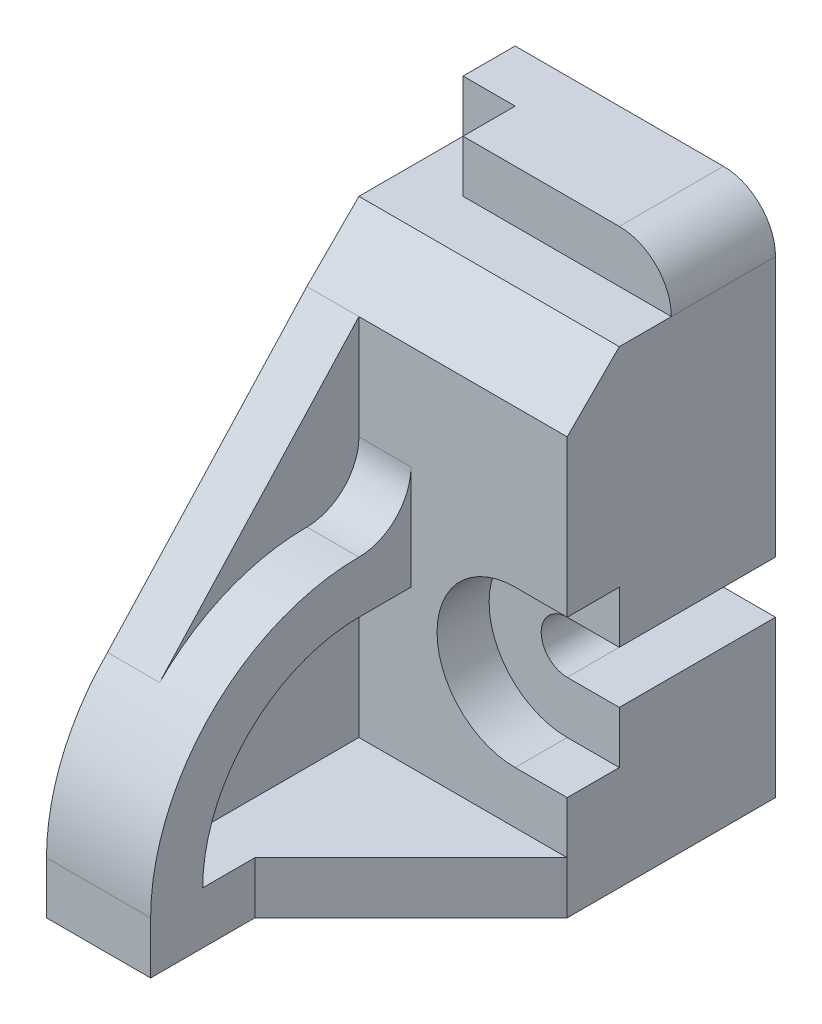
ISO-10303-21;
HEADER;
FILE_DESCRIPTION(('STEP AP214'),'2;1');
FILE_NAME('part.step','',(''),(''),'','','');
FILE_SCHEMA(('AUTOMOTIVE_DESIGN { 1 0 10303 214 1 1 1 1 }'));
ENDSEC;
DATA;
#1=APPLICATION_CONTEXT('core data for automotive mechanical design processes');
#2=APPLICATION_PROTOCOL_DEFINITION('international standard','automotive_design',2000,#1);
#3=PRODUCT_CONTEXT('',#1,'mechanical');
#4=PRODUCT('Part','Part','',(#3));
#5=PRODUCT_RELATED_PRODUCT_CATEGORY('part','',(#4));
#6=PRODUCT_DEFINITION_FORMATION('','',#4);
#7=PRODUCT_DEFINITION_CONTEXT('part definition',#1,'design');
#8=PRODUCT_DEFINITION('design','',#6,#7);
#9=PRODUCT_DEFINITION_SHAPE('','',#8);
#10=(LENGTH_UNIT() NAMED_UNIT(*) SI_UNIT(.MILLI.,.METRE.));
#11=(NAMED_UNIT(*) PLANE_ANGLE_UNIT() SI_UNIT($,.RADIAN.));
#12=(NAMED_UNIT(*) SI_UNIT($,.STERADIAN.) SOLID_ANGLE_UNIT());
#13=UNCERTAINTY_MEASURE_WITH_UNIT(LENGTH_MEASURE(1.E-05),#10,'distance_accuracy_value','');
#14=(GEOMETRIC_REPRESENTATION_CONTEXT(3) GLOBAL_UNCERTAINTY_ASSIGNED_CONTEXT((#13)) GLOBAL_UNIT_ASSIGNED_CONTEXT((#10,
#11,#12)) REPRESENTATION_CONTEXT('',''));
#15=CARTESIAN_POINT('',(0.,0.,0.));
#16=DIRECTION('',(0.,0.,1.));
#17=DIRECTION('',(1.,0.,0.));
#18=AXIS2_PLACEMENT_3D('',#15,#16,#17);
#19=CARTESIAN_POINT('',(0.,0.,4.));
#20=DIRECTION('',(0.,0.,1.));
#21=DIRECTION('',(1.,0.,0.));
#22=AXIS2_PLACEMENT_3D('',#19,#20,#21);
#23=PLANE('',#22);
#24=DIRECTION('',(1.,0.,0.));
#25=VECTOR('',#24,1.);
#26=CARTESIAN_POINT('',(0.,8.,4.));
#27=LINE('',#26,#25);
#28=CARTESIAN_POINT('',(1.,8.,4.));
#29=VERTEX_POINT('',#28);
#30=CARTESIAN_POINT('',(5.,8.,4.));
#31=VERTEX_POINT('',#30);
#32=EDGE_CURVE('E298',#29,#31,#27,.T.);
#33=ORIENTED_EDGE('',*,*,#32,.F.);
#34=DIRECTION('',(0.,-1.,0.));
#35=VECTOR('',#34,1.);
#36=CARTESIAN_POINT('',(1.,8.,4.));
#37=LINE('',#36,#35);
#38=CARTESIAN_POINT('',(1.,6.,4.));
#39=VERTEX_POINT('',#38);
#40=EDGE_CURVE('E245',#29,#39,#37,.T.);
#41=ORIENTED_EDGE('',*,*,#40,.T.);
#42=DIRECTION('',(-1.,0.,0.));
#43=VECTOR('',#42,1.);
#44=CARTESIAN_POINT('',(2.,6.,4.));
#45=LINE('',#44,#43);
#46=CARTESIAN_POINT('',(2.,6.,4.));
#47=VERTEX_POINT('',#46);
#48=EDGE_CURVE('E257',#47,#39,#45,.T.);
#49=ORIENTED_EDGE('',*,*,#48,.F.);
#50=DIRECTION('',(0.,1.,0.));
#51=VECTOR('',#50,1.);
#52=CARTESIAN_POINT('',(2.,0.,4.));
#53=LINE('',#52,#51);
#54=CARTESIAN_POINT('',(2.,4.,4.));
#55=VERTEX_POINT('',#54);
#56=EDGE_CURVE('E522',#55,#47,#53,.T.);
#57=ORIENTED_EDGE('',*,*,#56,.F.);
#58=DIRECTION('',(-1.,0.,0.));
#59=VECTOR('',#58,1.);
#60=CARTESIAN_POINT('',(2.,4.,4.));
#61=LINE('',#60,#59);
#62=CARTESIAN_POINT('',(1.,4.,4.));
#63=VERTEX_POINT('',#62);
#64=EDGE_CURVE('E261',#55,#63,#61,.T.);
#65=ORIENTED_EDGE('',*,*,#64,.T.);
#66=CARTESIAN_POINT('',(1.,1.,4.));
#67=VERTEX_POINT('',#66);
#68=EDGE_CURVE('E52',#63,#67,#37,.T.);
#69=ORIENTED_EDGE('',*,*,#68,.T.);
#70=DIRECTION('',(1.,0.,0.));
#71=VECTOR('',#70,1.);
#72=CARTESIAN_POINT('',(5.,1.,4.));
#73=LINE('',#72,#71);
#74=CARTESIAN_POINT('',(5.,1.,4.));
#75=VERTEX_POINT('',#74);
#76=EDGE_CURVE('E39',#67,#75,#73,.T.);
#77=ORIENTED_EDGE('',*,*,#76,.T.);
#78=DIRECTION('',(0.,-1.,0.));
#79=VECTOR('',#78,1.);
#80=CARTESIAN_POINT('',(5.,0.,4.));
#81=LINE('',#80,#79);
#82=CARTESIAN_POINT('',(5.,2.,4.));
#83=VERTEX_POINT('',#82);
#84=EDGE_CURVE('E381',#83,#75,#81,.T.);
#85=ORIENTED_EDGE('',*,*,#84,.F.);
#86=DIRECTION('',(1.,0.,0.));
#87=VECTOR('',#86,1.);
#88=CARTESIAN_POINT('',(5.,2.,4.));
#89=LINE('',#88,#87);
#90=CARTESIAN_POINT('',(4.,2.,4.));
#91=VERTEX_POINT('',#90);
#92=EDGE_CURVE('E341',#91,#83,#89,.T.);
#93=ORIENTED_EDGE('',*,*,#92,.F.);
#94=CARTESIAN_POINT('',(4.,3.5,4.));
#95=DIRECTION('',(0.,0.,1.));
#96=DIRECTION('',(1.,0.,0.));
#97=AXIS2_PLACEMENT_3D('',#94,#95,#96);
#98=CIRCLE('',#97,1.5);
#99=CARTESIAN_POINT('',(4.,5.,4.));
#100=VERTEX_POINT('',#99);
#101=EDGE_CURVE('E362',#100,#91,#98,.T.);
#102=ORIENTED_EDGE('',*,*,#101,.F.);
#103=DIRECTION('',(-1.,0.,0.));
#104=VECTOR('',#103,1.);
#105=CARTESIAN_POINT('',(5.,5.,4.));
#106=LINE('',#105,#104);
#107=CARTESIAN_POINT('',(5.,5.,4.));
#108=VERTEX_POINT('',#107);
#109=EDGE_CURVE('E332',#108,#100,#106,.T.);
#110=ORIENTED_EDGE('',*,*,#109,.F.);
#111=DIRECTION('',(0.,-1.,0.));
#112=VECTOR('',#111,1.);
#113=CARTESIAN_POINT('',(5.,0.,4.));
#114=LINE('',#113,#112);
#115=EDGE_CURVE('E378',#31,#108,#114,.T.);
#116=ORIENTED_EDGE('',*,*,#115,.F.);
#117=EDGE_LOOP('',(#33,#41,#49,#57,#65,#69,#77,#85,#93,#102,#110,#116));
#118=FACE_BOUND('',#117,.T.);
#119=ADVANCED_FACE('F35',(#118),#23,.T.);
#120=CARTESIAN_POINT('',(0.,1.,0.));
#121=DIRECTION('',(0.,1.,0.));
#122=DIRECTION('',(0.,0.,1.));
#123=AXIS2_PLACEMENT_3D('',#120,#121,#122);
#124=PLANE('',#123);
#125=ORIENTED_EDGE('',*,*,#76,.F.);
#126=DIRECTION('',(0.,0.,1.));
#127=VECTOR('',#126,1.);
#128=CARTESIAN_POINT('',(1.,1.,4.));
#129=LINE('',#128,#127);
#130=CARTESIAN_POINT('',(1.,1.,8.));
#131=VERTEX_POINT('',#130);
#132=EDGE_CURVE('E529',#67,#131,#129,.T.);
#133=ORIENTED_EDGE('',*,*,#132,.T.);
#134=DIRECTION('',(-1.,0.,0.));
#135=VECTOR('',#134,1.);
#136=CARTESIAN_POINT('',(2.,1.,8.));
#137=LINE('',#136,#135);
#138=CARTESIAN_POINT('',(2.,1.,8.));
#139=VERTEX_POINT('',#138);
#140=EDGE_CURVE('E258',#139,#131,#137,.T.);
#141=ORIENTED_EDGE('',*,*,#140,.F.);
#142=DIRECTION('',(0.,0.,1.));
#143=VECTOR('',#142,1.);
#144=CARTESIAN_POINT('',(2.,1.,9.));
#145=LINE('',#144,#143);
#146=CARTESIAN_POINT('',(2.,1.,7.));
#147=VERTEX_POINT('',#146);
#148=EDGE_CURVE('E269',#147,#139,#145,.T.);
#149=ORIENTED_EDGE('',*,*,#148,.F.);
#150=DIRECTION('',(-0.707106781186547,0.,0.707106781186548));
#151=VECTOR('',#150,1.);
#152=CARTESIAN_POINT('',(2.,1.,7.));
#153=LINE('',#152,#151);
#154=EDGE_CURVE('E273',#75,#147,#153,.T.);
#155=ORIENTED_EDGE('',*,*,#154,.F.);
#156=EDGE_LOOP('',(#125,#133,#141,#149,#155));
#157=FACE_BOUND('',#156,.T.);
#158=ADVANCED_FACE('F496',(#157),#124,.T.);
#159=CARTESIAN_POINT('',(2.,3.99999999999998,0.));
#160=DIRECTION('',(0.,1.,0.));
#161=DIRECTION('',(0.,0.,1.));
#162=AXIS2_PLACEMENT_3D('',#159,#160,#161);
#163=PLANE('',#162);
#164=DIRECTION('',(0.,0.,1.));
#165=VECTOR('',#164,1.);
#166=CARTESIAN_POINT('',(1.,3.99999999999998,0.));
#167=LINE('',#166,#165);
#168=CARTESIAN_POINT('',(1.,4.,5.));
#169=VERTEX_POINT('',#168);
#170=EDGE_CURVE('E527',#63,#169,#167,.T.);
#171=ORIENTED_EDGE('',*,*,#170,.F.);
#172=ORIENTED_EDGE('',*,*,#64,.F.);
#173=DIRECTION('',(0.,0.,-1.));
#174=VECTOR('',#173,1.);
#175=CARTESIAN_POINT('',(2.,3.99999999999998,0.));
#176=LINE('',#175,#174);
#177=CARTESIAN_POINT('',(2.,4.,5.));
#178=VERTEX_POINT('',#177);
#179=EDGE_CURVE('E264',#178,#55,#176,.T.);
#180=ORIENTED_EDGE('',*,*,#179,.F.);
#181=DIRECTION('',(-1.,0.,0.));
#182=VECTOR('',#181,1.);
#183=CARTESIAN_POINT('',(2.,4.,5.));
#184=LINE('',#183,#182);
#185=EDGE_CURVE('E281',#178,#169,#184,.T.);
#186=ORIENTED_EDGE('',*,*,#185,.T.);
#187=EDGE_LOOP('',(#171,#172,#180,#186));
#188=FACE_BOUND('',#187,.T.);
#189=ADVANCED_FACE('F549',(#188),#163,.F.);
#190=CARTESIAN_POINT('',(2.,6.,5.));
#191=DIRECTION('',(-1.,0.,0.));
#192=DIRECTION('',(0.,0.,1.));
#193=AXIS2_PLACEMENT_3D('',#190,#191,#192);
#194=CYLINDRICAL_SURFACE('',#193,1.);
#195=CARTESIAN_POINT('',(1.,6.,5.));
#196=DIRECTION('',(-1.,0.,0.));
#197=DIRECTION('',(0.,0.,1.));
#198=AXIS2_PLACEMENT_3D('',#195,#196,#197);
#199=CIRCLE('',#198,1.);
#200=CARTESIAN_POINT('',(1.,5.,5.));
#201=VERTEX_POINT('',#200);
#202=EDGE_CURVE('E238',#201,#39,#199,.F.);
#203=ORIENTED_EDGE('',*,*,#202,.F.);
#204=DIRECTION('',(-1.,0.,0.));
#205=VECTOR('',#204,1.);
#206=CARTESIAN_POINT('',(2.,5.,5.));
#207=LINE('',#206,#205);
#208=CARTESIAN_POINT('',(2.,5.,5.));
#209=VERTEX_POINT('',#208);
#210=EDGE_CURVE('E252',#209,#201,#207,.T.);
#211=ORIENTED_EDGE('',*,*,#210,.F.);
#212=CARTESIAN_POINT('',(2.,6.,5.));
#213=DIRECTION('',(-1.,0.,0.));
#214=DIRECTION('',(0.,0.,1.));
#215=AXIS2_PLACEMENT_3D('',#212,#213,#214);
#216=CIRCLE('',#215,1.);
#217=EDGE_CURVE('E546',#47,#209,#216,.T.);
#218=ORIENTED_EDGE('',*,*,#217,.F.);
#219=ORIENTED_EDGE('',*,*,#48,.T.);
#220=EDGE_LOOP('',(#203,#211,#218,#219));
#221=FACE_BOUND('',#220,.T.);
#222=ADVANCED_FACE('F584',(#221),#194,.F.);
#223=CARTESIAN_POINT('',(0.,3.,4.));
#224=DIRECTION('',(0.,1.,0.));
#225=DIRECTION('',(0.,0.,1.));
#226=AXIS2_PLACEMENT_3D('',#223,#224,#225);
#227=PLANE('',#226);
#228=DIRECTION('',(0.,0.,-1.));
#229=VECTOR('',#228,1.);
#230=CARTESIAN_POINT('',(4.,3.,4.));
#231=LINE('',#230,#229);
#232=CARTESIAN_POINT('',(4.,3.,3.));
#233=VERTEX_POINT('',#232);
#234=CARTESIAN_POINT('',(4.,3.,0.));
#235=VERTEX_POINT('',#234);
#236=EDGE_CURVE('E409',#233,#235,#231,.T.);
#237=ORIENTED_EDGE('',*,*,#236,.F.);
#238=DIRECTION('',(-1.,0.,0.));
#239=VECTOR('',#238,1.);
#240=CARTESIAN_POINT('',(5.,3.,3.));
#241=LINE('',#240,#239);
#242=CARTESIAN_POINT('',(5.,3.,3.));
#243=VERTEX_POINT('',#242);
#244=EDGE_CURVE('E338',#243,#233,#241,.T.);
#245=ORIENTED_EDGE('',*,*,#244,.F.);
#246=DIRECTION('',(0.,0.,-1.));
#247=VECTOR('',#246,1.);
#248=CARTESIAN_POINT('',(5.,3.,4.));
#249=LINE('',#248,#247);
#250=CARTESIAN_POINT('',(5.,3.,0.));
#251=VERTEX_POINT('',#250);
#252=EDGE_CURVE('E408',#243,#251,#249,.T.);
#253=ORIENTED_EDGE('',*,*,#252,.T.);
#254=DIRECTION('',(1.,0.,0.));
#255=VECTOR('',#254,1.);
#256=CARTESIAN_POINT('',(0.,3.,0.));
#257=LINE('',#256,#255);
#258=EDGE_CURVE('E438',#235,#251,#257,.T.);
#259=ORIENTED_EDGE('',*,*,#258,.F.);
#260=EDGE_LOOP('',(#237,#245,#253,#259));
#261=FACE_BOUND('',#260,.T.);
#262=ADVANCED_FACE('F480',(#261),#227,.T.);
#263=CARTESIAN_POINT('',(4.,3.5,4.));
#264=DIRECTION('',(0.,0.,-1.));
#265=DIRECTION('',(-1.,0.,0.));
#266=AXIS2_PLACEMENT_3D('',#263,#264,#265);
#267=CYLINDRICAL_SURFACE('',#266,0.5);
#268=DIRECTION('',(0.,0.,-1.));
#269=VECTOR('',#268,1.);
#270=CARTESIAN_POINT('',(4.,4.,4.));
#271=LINE('',#270,#269);
#272=CARTESIAN_POINT('',(4.,4.,3.));
#273=VERTEX_POINT('',#272);
#274=CARTESIAN_POINT('',(4.,4.,0.));
#275=VERTEX_POINT('',#274);
#276=EDGE_CURVE('E413',#273,#275,#271,.T.);
#277=ORIENTED_EDGE('',*,*,#276,.F.);
#278=CARTESIAN_POINT('',(4.,3.5,3.));
#279=DIRECTION('',(0.,0.,-1.));
#280=DIRECTION('',(1.,0.,0.));
#281=AXIS2_PLACEMENT_3D('',#278,#279,#280);
#282=CIRCLE('',#281,0.5);
#283=EDGE_CURVE('E340',#233,#273,#282,.T.);
#284=ORIENTED_EDGE('',*,*,#283,.F.);
#285=ORIENTED_EDGE('',*,*,#236,.T.);
#286=CARTESIAN_POINT('',(4.,3.5,0.));
#287=DIRECTION('',(0.,0.,1.));
#288=DIRECTION('',(1.,0.,0.));
#289=AXIS2_PLACEMENT_3D('',#286,#287,#288);
#290=CIRCLE('',#289,0.5);
#291=EDGE_CURVE('E435',#275,#235,#290,.T.);
#292=ORIENTED_EDGE('',*,*,#291,.F.);
#293=EDGE_LOOP('',(#277,#284,#285,#292));
#294=FACE_BOUND('',#293,.T.);
#295=ADVANCED_FACE('F475',(#294),#267,.F.);
#296=CARTESIAN_POINT('',(0.,4.00000000000001,4.));
#297=DIRECTION('',(0.,-1.,0.));
#298=DIRECTION('',(1.,0.,0.));
#299=AXIS2_PLACEMENT_3D('',#296,#297,#298);
#300=PLANE('',#299);
#301=DIRECTION('',(0.,0.,-1.));
#302=VECTOR('',#301,1.);
#303=CARTESIAN_POINT('',(5.,4.,4.));
#304=LINE('',#303,#302);
#305=CARTESIAN_POINT('',(5.,4.,3.));
#306=VERTEX_POINT('',#305);
#307=CARTESIAN_POINT('',(5.,4.,0.));
#308=VERTEX_POINT('',#307);
#309=EDGE_CURVE('E415',#306,#308,#304,.T.);
#310=ORIENTED_EDGE('',*,*,#309,.F.);
#311=DIRECTION('',(1.,0.,0.));
#312=VECTOR('',#311,1.);
#313=CARTESIAN_POINT('',(5.,4.,3.));
#314=LINE('',#313,#312);
#315=EDGE_CURVE('E343',#273,#306,#314,.T.);
#316=ORIENTED_EDGE('',*,*,#315,.F.);
#317=ORIENTED_EDGE('',*,*,#276,.T.);
#318=DIRECTION('',(-1.,0.,0.));
#319=VECTOR('',#318,1.);
#320=CARTESIAN_POINT('',(0.,4.00000000000001,0.));
#321=LINE('',#320,#319);
#322=EDGE_CURVE('E432',#308,#275,#321,.T.);
#323=ORIENTED_EDGE('',*,*,#322,.F.);
#324=EDGE_LOOP('',(#310,#316,#317,#323));
#325=FACE_BOUND('',#324,.T.);
#326=ADVANCED_FACE('F470',(#325),#300,.T.);
#327=CARTESIAN_POINT('',(0.,0.,4.));
#328=DIRECTION('',(-1.,0.,0.));
#329=DIRECTION('',(0.,0.,1.));
#330=AXIS2_PLACEMENT_3D('',#327,#328,#329);
#331=PLANE('',#330);
#332=DIRECTION('',(0.,0.7367594231393,-0.676154976625511));
#333=VECTOR('',#332,1.);
#334=CARTESIAN_POINT('',(0.,8.,4.));
#335=LINE('',#334,#333);
#336=CARTESIAN_POINT('',(0.,3.82842712474619,7.82842712474619));
#337=VERTEX_POINT('',#336);
#338=CARTESIAN_POINT('',(0.,8.,4.));
#339=VERTEX_POINT('',#338);
#340=EDGE_CURVE('E235',#337,#339,#335,.T.);
#341=ORIENTED_EDGE('',*,*,#340,.T.);
#342=DIRECTION('',(0.,0.707106781186548,-0.707106781186547));
#343=VECTOR('',#342,1.);
#344=CARTESIAN_POINT('',(0.,9.,3.));
#345=LINE('',#344,#343);
#346=CARTESIAN_POINT('',(0.,9.,3.));
#347=VERTEX_POINT('',#346);
#348=EDGE_CURVE('E295',#339,#347,#345,.T.);
#349=ORIENTED_EDGE('',*,*,#348,.T.);
#350=DIRECTION('',(0.,0.,1.));
#351=VECTOR('',#350,1.);
#352=CARTESIAN_POINT('',(0.,9.,1.));
#353=LINE('',#352,#351);
#354=CARTESIAN_POINT('',(0.,9.,1.));
#355=VERTEX_POINT('',#354);
#356=EDGE_CURVE('E328',#355,#347,#353,.T.);
#357=ORIENTED_EDGE('',*,*,#356,.F.);
#358=DIRECTION('',(0.,-1.,0.));
#359=VECTOR('',#358,1.);
#360=CARTESIAN_POINT('',(0.,9.,1.));
#361=LINE('',#360,#359);
#362=CARTESIAN_POINT('',(0.,10.,1.));
#363=VERTEX_POINT('',#362);
#364=EDGE_CURVE('E317',#363,#355,#361,.T.);
#365=ORIENTED_EDGE('',*,*,#364,.F.);
#366=DIRECTION('',(0.,0.,-1.));
#367=VECTOR('',#366,1.);
#368=CARTESIAN_POINT('',(0.,10.,4.));
#369=LINE('',#368,#367);
#370=CARTESIAN_POINT('',(0.,10.,0.));
#371=VERTEX_POINT('',#370);
#372=EDGE_CURVE('E422',#363,#371,#369,.T.);
#373=ORIENTED_EDGE('',*,*,#372,.T.);
#374=DIRECTION('',(0.,1.,0.));
#375=VECTOR('',#374,1.);
#376=CARTESIAN_POINT('',(0.,0.,0.));
#377=LINE('',#376,#375);
#378=CARTESIAN_POINT('',(0.,0.,0.));
#379=VERTEX_POINT('',#378);
#380=EDGE_CURVE('E369',#379,#371,#377,.T.);
#381=ORIENTED_EDGE('',*,*,#380,.F.);
#382=DIRECTION('',(0.,0.,-1.));
#383=VECTOR('',#382,1.);
#384=CARTESIAN_POINT('',(0.,0.,4.));
#385=LINE('',#384,#383);
#386=CARTESIAN_POINT('',(0.,0.,9.));
#387=VERTEX_POINT('',#386);
#388=EDGE_CURVE('E45',#387,#379,#385,.T.);
#389=ORIENTED_EDGE('',*,*,#388,.F.);
#390=DIRECTION('',(0.,-1.,0.));
#391=VECTOR('',#390,1.);
#392=CARTESIAN_POINT('',(0.,1.,9.));
#393=LINE('',#392,#391);
#394=CARTESIAN_POINT('',(0.,1.,9.));
#395=VERTEX_POINT('',#394);
#396=EDGE_CURVE('E287',#395,#387,#393,.T.);
#397=ORIENTED_EDGE('',*,*,#396,.F.);
#398=CARTESIAN_POINT('',(0.,1.,5.));
#399=DIRECTION('',(-1.,0.,0.));
#400=DIRECTION('',(0.,0.,1.));
#401=AXIS2_PLACEMENT_3D('',#398,#399,#400);
#402=CIRCLE('',#401,4.);
#403=EDGE_CURVE('E508',#395,#337,#402,.T.);
#404=ORIENTED_EDGE('',*,*,#403,.T.);
#405=EDGE_LOOP('',(#341,#349,#357,#365,#373,#381,#389,#397,#404));
#406=FACE_BOUND('',#405,.T.);
#407=DIRECTION('',(0.,0.998165233712206,-0.0605488745416274));
#408=VECTOR('',#407,1.);
#409=CARTESIAN_POINT('',(0.,1.,8.));
#410=LINE('',#409,#408);
#411=CARTESIAN_POINT('',(0.,1.,8.));
#412=VERTEX_POINT('',#411);
#413=CARTESIAN_POINT('',(0.,1.36262668904713,7.97800300275045));
#414=VERTEX_POINT('',#413);
#415=EDGE_CURVE('E531',#412,#414,#410,.T.);
#416=ORIENTED_EDGE('',*,*,#415,.T.);
#417=CARTESIAN_POINT('',(0.,1.,5.));
#418=DIRECTION('',(-1.,0.,0.));
#419=DIRECTION('',(0.,0.,1.));
#420=AXIS2_PLACEMENT_3D('',#417,#418,#419);
#421=CIRCLE('',#420,3.);
#422=EDGE_CURVE('E511',#412,#414,#421,.T.);
#423=ORIENTED_EDGE('',*,*,#422,.F.);
#424=EDGE_LOOP('',(#416,#423));
#425=FACE_BOUND('',#424,.T.);
#426=ADVANCED_FACE('F37',(#406,#425),#331,.T.);
#427=CARTESIAN_POINT('',(0.,0.,4.));
#428=DIRECTION('',(0.,-1.,0.));
#429=DIRECTION('',(0.,0.,-1.));
#430=AXIS2_PLACEMENT_3D('',#427,#428,#429);
#431=PLANE('',#430);
#432=DIRECTION('',(-1.,0.,0.));
#433=VECTOR('',#432,1.);
#434=CARTESIAN_POINT('',(0.,0.,0.));
#435=LINE('',#434,#433);
#436=CARTESIAN_POINT('',(5.,0.,0.));
#437=VERTEX_POINT('',#436);
#438=EDGE_CURVE('E406',#437,#379,#435,.T.);
#439=ORIENTED_EDGE('',*,*,#438,.F.);
#440=DIRECTION('',(0.,0.,-1.));
#441=VECTOR('',#440,1.);
#442=CARTESIAN_POINT('',(5.,0.,4.));
#443=LINE('',#442,#441);
#444=CARTESIAN_POINT('',(5.,0.,4.));
#445=VERTEX_POINT('',#444);
#446=EDGE_CURVE('E399',#445,#437,#443,.T.);
#447=ORIENTED_EDGE('',*,*,#446,.F.);
#448=DIRECTION('',(-0.707106781186547,0.,0.707106781186548));
#449=VECTOR('',#448,1.);
#450=CARTESIAN_POINT('',(2.,0.,7.));
#451=LINE('',#450,#449);
#452=CARTESIAN_POINT('',(2.,0.,7.));
#453=VERTEX_POINT('',#452);
#454=EDGE_CURVE('E277',#445,#453,#451,.T.);
#455=ORIENTED_EDGE('',*,*,#454,.T.);
#456=DIRECTION('',(0.,0.,1.));
#457=VECTOR('',#456,1.);
#458=CARTESIAN_POINT('',(2.,0.,9.));
#459=LINE('',#458,#457);
#460=CARTESIAN_POINT('',(2.,0.,9.));
#461=VERTEX_POINT('',#460);
#462=EDGE_CURVE('E280',#453,#461,#459,.T.);
#463=ORIENTED_EDGE('',*,*,#462,.T.);
#464=DIRECTION('',(-1.,0.,0.));
#465=VECTOR('',#464,1.);
#466=CARTESIAN_POINT('',(0.,0.,9.));
#467=LINE('',#466,#465);
#468=EDGE_CURVE('E284',#461,#387,#467,.T.);
#469=ORIENTED_EDGE('',*,*,#468,.T.);
#470=ORIENTED_EDGE('',*,*,#388,.T.);
#471=EDGE_LOOP('',(#439,#447,#455,#463,#469,#470));
#472=FACE_BOUND('',#471,.T.);
#473=ADVANCED_FACE('F404',(#472),#431,.T.);
#474=CARTESIAN_POINT('',(5.,0.,4.));
#475=DIRECTION('',(1.,0.,0.));
#476=DIRECTION('',(0.,0.,-1.));
#477=AXIS2_PLACEMENT_3D('',#474,#475,#476);
#478=PLANE('',#477);
#479=DIRECTION('',(0.,0.,1.));
#480=VECTOR('',#479,1.);
#481=CARTESIAN_POINT('',(5.,2.,3.));
#482=LINE('',#481,#480);
#483=CARTESIAN_POINT('',(5.,2.,3.));
#484=VERTEX_POINT('',#483);
#485=EDGE_CURVE('E366',#484,#83,#482,.T.);
#486=ORIENTED_EDGE('',*,*,#485,.T.);
#487=ORIENTED_EDGE('',*,*,#84,.T.);
#488=DIRECTION('',(0.,-1.,0.));
#489=VECTOR('',#488,1.);
#490=CARTESIAN_POINT('',(5.,1.,4.));
#491=LINE('',#490,#489);
#492=EDGE_CURVE('E276',#75,#445,#491,.T.);
#493=ORIENTED_EDGE('',*,*,#492,.T.);
#494=ORIENTED_EDGE('',*,*,#446,.T.);
#495=DIRECTION('',(0.,-1.,0.));
#496=VECTOR('',#495,1.);
#497=CARTESIAN_POINT('',(5.,0.,0.));
#498=LINE('',#497,#496);
#499=EDGE_CURVE('E441',#251,#437,#498,.T.);
#500=ORIENTED_EDGE('',*,*,#499,.F.);
#501=ORIENTED_EDGE('',*,*,#252,.F.);
#502=DIRECTION('',(0.,1.,0.));
#503=VECTOR('',#502,1.);
#504=CARTESIAN_POINT('',(5.,3.,3.));
#505=LINE('',#504,#503);
#506=EDGE_CURVE('E357',#484,#243,#505,.T.);
#507=ORIENTED_EDGE('',*,*,#506,.F.);
#508=EDGE_LOOP('',(#486,#487,#493,#494,#500,#501,#507));
#509=FACE_BOUND('',#508,.T.);
#510=ADVANCED_FACE('F397',(#509),#478,.T.);
#511=CARTESIAN_POINT('',(5.,0.,4.));
#512=DIRECTION('',(1.,0.,0.));
#513=DIRECTION('',(0.,0.,-1.));
#514=AXIS2_PLACEMENT_3D('',#511,#512,#513);
#515=PLANE('',#514);
#516=DIRECTION('',(0.,0.707106781186548,-0.707106781186547));
#517=VECTOR('',#516,1.);
#518=CARTESIAN_POINT('',(5.,9.,3.));
#519=LINE('',#518,#517);
#520=CARTESIAN_POINT('',(5.,9.,3.));
#521=VERTEX_POINT('',#520);
#522=EDGE_CURVE('E290',#31,#521,#519,.T.);
#523=ORIENTED_EDGE('',*,*,#522,.F.);
#524=ORIENTED_EDGE('',*,*,#115,.T.);
#525=DIRECTION('',(0.,0.,1.));
#526=VECTOR('',#525,1.);
#527=CARTESIAN_POINT('',(5.,5.,3.));
#528=LINE('',#527,#526);
#529=CARTESIAN_POINT('',(5.,5.,3.));
#530=VERTEX_POINT('',#529);
#531=EDGE_CURVE('E359',#530,#108,#528,.T.);
#532=ORIENTED_EDGE('',*,*,#531,.F.);
#533=DIRECTION('',(0.,1.,0.));
#534=VECTOR('',#533,1.);
#535=CARTESIAN_POINT('',(5.,4.,3.));
#536=LINE('',#535,#534);
#537=EDGE_CURVE('E345',#306,#530,#536,.T.);
#538=ORIENTED_EDGE('',*,*,#537,.F.);
#539=ORIENTED_EDGE('',*,*,#309,.T.);
#540=DIRECTION('',(0.,-1.,0.));
#541=VECTOR('',#540,1.);
#542=CARTESIAN_POINT('',(5.,0.,0.));
#543=LINE('',#542,#541);
#544=CARTESIAN_POINT('',(5.,9.,0.));
#545=VERTEX_POINT('',#544);
#546=EDGE_CURVE('E429',#545,#308,#543,.T.);
#547=ORIENTED_EDGE('',*,*,#546,.F.);
#548=DIRECTION('',(0.,0.,-1.));
#549=VECTOR('',#548,1.);
#550=CARTESIAN_POINT('',(5.,9.,4.));
#551=LINE('',#550,#549);
#552=CARTESIAN_POINT('',(5.,9.,2.));
#553=VERTEX_POINT('',#552);
#554=EDGE_CURVE('E419',#553,#545,#551,.T.);
#555=ORIENTED_EDGE('',*,*,#554,.F.);
#556=EDGE_CURVE('E417',#521,#553,#551,.T.);
#557=ORIENTED_EDGE('',*,*,#556,.F.);
#558=EDGE_LOOP('',(#523,#524,#532,#538,#539,#547,#555,#557));
#559=FACE_BOUND('',#558,.T.);
#560=ADVANCED_FACE('F462',(#559),#515,.T.);
#561=CARTESIAN_POINT('',(4.,9.,4.));
#562=DIRECTION('',(0.,0.,-1.));
#563=DIRECTION('',(-1.,0.,0.));
#564=AXIS2_PLACEMENT_3D('',#561,#562,#563);
#565=CYLINDRICAL_SURFACE('',#564,1.);
#566=DIRECTION('',(0.,0.,-1.));
#567=VECTOR('',#566,1.);
#568=CARTESIAN_POINT('',(4.,10.,4.));
#569=LINE('',#568,#567);
#570=CARTESIAN_POINT('',(4.,10.,2.));
#571=VERTEX_POINT('',#570);
#572=CARTESIAN_POINT('',(4.,10.,0.));
#573=VERTEX_POINT('',#572);
#574=EDGE_CURVE('E420',#571,#573,#569,.T.);
#575=ORIENTED_EDGE('',*,*,#574,.F.);
#576=CARTESIAN_POINT('',(4.,9.,2.));
#577=DIRECTION('',(0.,0.,-1.));
#578=DIRECTION('',(-1.,0.,0.));
#579=AXIS2_PLACEMENT_3D('',#576,#577,#578);
#580=CIRCLE('',#579,1.);
#581=EDGE_CURVE('E314',#571,#553,#580,.T.);
#582=ORIENTED_EDGE('',*,*,#581,.T.);
#583=ORIENTED_EDGE('',*,*,#554,.T.);
#584=CARTESIAN_POINT('',(4.,9.,0.));
#585=DIRECTION('',(0.,0.,1.));
#586=DIRECTION('',(1.,0.,0.));
#587=AXIS2_PLACEMENT_3D('',#584,#585,#586);
#588=CIRCLE('',#587,1.);
#589=EDGE_CURVE('E426',#545,#573,#588,.T.);
#590=ORIENTED_EDGE('',*,*,#589,.T.);
#591=EDGE_LOOP('',(#575,#582,#583,#590));
#592=FACE_BOUND('',#591,.T.);
#593=ADVANCED_FACE('F457',(#592),#565,.T.);
#594=CARTESIAN_POINT('',(0.,10.,4.));
#595=DIRECTION('',(0.,1.,0.));
#596=DIRECTION('',(0.,0.,1.));
#597=AXIS2_PLACEMENT_3D('',#594,#595,#596);
#598=PLANE('',#597);
#599=DIRECTION('',(-1.,0.,0.));
#600=VECTOR('',#599,1.);
#601=CARTESIAN_POINT('',(5.,10.,2.));
#602=LINE('',#601,#600);
#603=CARTESIAN_POINT('',(1.,10.,2.));
#604=VERTEX_POINT('',#603);
#605=EDGE_CURVE('E303',#571,#604,#602,.T.);
#606=ORIENTED_EDGE('',*,*,#605,.F.);
#607=ORIENTED_EDGE('',*,*,#574,.T.);
#608=DIRECTION('',(1.,0.,0.));
#609=VECTOR('',#608,1.);
#610=CARTESIAN_POINT('',(0.,10.,0.));
#611=LINE('',#610,#609);
#612=EDGE_CURVE('E385',#371,#573,#611,.T.);
#613=ORIENTED_EDGE('',*,*,#612,.F.);
#614=ORIENTED_EDGE('',*,*,#372,.F.);
#615=DIRECTION('',(-1.,0.,0.));
#616=VECTOR('',#615,1.);
#617=CARTESIAN_POINT('',(0.,10.,1.));
#618=LINE('',#617,#616);
#619=CARTESIAN_POINT('',(1.,10.,1.));
#620=VERTEX_POINT('',#619);
#621=EDGE_CURVE('E326',#620,#363,#618,.T.);
#622=ORIENTED_EDGE('',*,*,#621,.F.);
#623=DIRECTION('',(0.,0.,1.));
#624=VECTOR('',#623,1.);
#625=CARTESIAN_POINT('',(1.,10.,1.));
#626=LINE('',#625,#624);
#627=EDGE_CURVE('E329',#620,#604,#626,.T.);
#628=ORIENTED_EDGE('',*,*,#627,.T.);
#629=EDGE_LOOP('',(#606,#607,#613,#614,#622,#628));
#630=FACE_BOUND('',#629,.T.);
#631=ADVANCED_FACE('F453',(#630),#598,.T.);
#632=CARTESIAN_POINT('',(0.,0.,0.));
#633=DIRECTION('',(0.,0.,1.));
#634=DIRECTION('',(1.,0.,0.));
#635=AXIS2_PLACEMENT_3D('',#632,#633,#634);
#636=PLANE('',#635);
#637=ORIENTED_EDGE('',*,*,#380,.T.);
#638=ORIENTED_EDGE('',*,*,#612,.T.);
#639=ORIENTED_EDGE('',*,*,#589,.F.);
#640=ORIENTED_EDGE('',*,*,#546,.T.);
#641=ORIENTED_EDGE('',*,*,#322,.T.);
#642=ORIENTED_EDGE('',*,*,#291,.T.);
#643=ORIENTED_EDGE('',*,*,#258,.T.);
#644=ORIENTED_EDGE('',*,*,#499,.T.);
#645=ORIENTED_EDGE('',*,*,#438,.T.);
#646=EDGE_LOOP('',(#637,#638,#639,#640,#641,#642,#643,#644,#645));
#647=FACE_BOUND('',#646,.T.);
#648=ADVANCED_FACE('F447',(#647),#636,.F.);
#649=CARTESIAN_POINT('',(5.,2.,3.));
#650=DIRECTION('',(0.,-1.,0.));
#651=DIRECTION('',(0.,0.,-1.));
#652=AXIS2_PLACEMENT_3D('',#649,#650,#651);
#653=PLANE('',#652);
#654=ORIENTED_EDGE('',*,*,#92,.T.);
#655=ORIENTED_EDGE('',*,*,#485,.F.);
#656=DIRECTION('',(1.,0.,0.));
#657=VECTOR('',#656,1.);
#658=CARTESIAN_POINT('',(5.,2.,3.));
#659=LINE('',#658,#657);
#660=CARTESIAN_POINT('',(4.,2.,3.));
#661=VERTEX_POINT('',#660);
#662=EDGE_CURVE('E354',#661,#484,#659,.T.);
#663=ORIENTED_EDGE('',*,*,#662,.F.);
#664=DIRECTION('',(0.,0.,1.));
#665=VECTOR('',#664,1.);
#666=CARTESIAN_POINT('',(4.,2.,3.));
#667=LINE('',#666,#665);
#668=EDGE_CURVE('E370',#661,#91,#667,.T.);
#669=ORIENTED_EDGE('',*,*,#668,.T.);
#670=EDGE_LOOP('',(#654,#655,#663,#669));
#671=FACE_BOUND('',#670,.T.);
#672=ADVANCED_FACE('F488',(#671),#653,.F.);
#673=CARTESIAN_POINT('',(4.,3.5,3.));
#674=DIRECTION('',(0.,0.,1.));
#675=DIRECTION('',(1.,0.,0.));
#676=AXIS2_PLACEMENT_3D('',#673,#674,#675);
#677=CYLINDRICAL_SURFACE('',#676,1.5);
#678=ORIENTED_EDGE('',*,*,#101,.T.);
#679=ORIENTED_EDGE('',*,*,#668,.F.);
#680=CARTESIAN_POINT('',(4.,3.5,3.));
#681=DIRECTION('',(0.,0.,1.));
#682=DIRECTION('',(1.,0.,0.));
#683=AXIS2_PLACEMENT_3D('',#680,#681,#682);
#684=CIRCLE('',#683,1.5);
#685=CARTESIAN_POINT('',(4.,5.,3.));
#686=VERTEX_POINT('',#685);
#687=EDGE_CURVE('E351',#686,#661,#684,.T.);
#688=ORIENTED_EDGE('',*,*,#687,.F.);
#689=DIRECTION('',(0.,0.,1.));
#690=VECTOR('',#689,1.);
#691=CARTESIAN_POINT('',(4.,5.,3.));
#692=LINE('',#691,#690);
#693=EDGE_CURVE('E372',#686,#100,#692,.T.);
#694=ORIENTED_EDGE('',*,*,#693,.T.);
#695=EDGE_LOOP('',(#678,#679,#688,#694));
#696=FACE_BOUND('',#695,.T.);
#697=ADVANCED_FACE('F618',(#696),#677,.F.);
#698=CARTESIAN_POINT('',(5.,5.,3.));
#699=DIRECTION('',(0.,1.,0.));
#700=DIRECTION('',(0.,0.,1.));
#701=AXIS2_PLACEMENT_3D('',#698,#699,#700);
#702=PLANE('',#701);
#703=ORIENTED_EDGE('',*,*,#109,.T.);
#704=ORIENTED_EDGE('',*,*,#693,.F.);
#705=DIRECTION('',(-1.,0.,0.));
#706=VECTOR('',#705,1.);
#707=CARTESIAN_POINT('',(5.,5.,3.));
#708=LINE('',#707,#706);
#709=EDGE_CURVE('E348',#530,#686,#708,.T.);
#710=ORIENTED_EDGE('',*,*,#709,.F.);
#711=ORIENTED_EDGE('',*,*,#531,.T.);
#712=EDGE_LOOP('',(#703,#704,#710,#711));
#713=FACE_BOUND('',#712,.T.);
#714=ADVANCED_FACE('F570',(#713),#702,.F.);
#715=CARTESIAN_POINT('',(4.,3.5,3.));
#716=DIRECTION('',(0.,0.,1.));
#717=DIRECTION('',(1.,0.,0.));
#718=AXIS2_PLACEMENT_3D('',#715,#716,#717);
#719=PLANE('',#718);
#720=ORIENTED_EDGE('',*,*,#244,.T.);
#721=ORIENTED_EDGE('',*,*,#283,.T.);
#722=ORIENTED_EDGE('',*,*,#315,.T.);
#723=ORIENTED_EDGE('',*,*,#537,.T.);
#724=ORIENTED_EDGE('',*,*,#709,.T.);
#725=ORIENTED_EDGE('',*,*,#687,.T.);
#726=ORIENTED_EDGE('',*,*,#662,.T.);
#727=ORIENTED_EDGE('',*,*,#506,.T.);
#728=EDGE_LOOP('',(#720,#721,#722,#723,#724,#725,#726,#727));
#729=FACE_BOUND('',#728,.T.);
#730=ADVANCED_FACE('F484',(#729),#719,.T.);
#731=CARTESIAN_POINT('',(1.,10.,1.));
#732=DIRECTION('',(1.,0.,0.));
#733=DIRECTION('',(0.,1.,0.));
#734=AXIS2_PLACEMENT_3D('',#731,#732,#733);
#735=PLANE('',#734);
#736=DIRECTION('',(0.,0.,1.));
#737=VECTOR('',#736,1.);
#738=CARTESIAN_POINT('',(1.,9.,1.));
#739=LINE('',#738,#737);
#740=CARTESIAN_POINT('',(1.,9.,1.));
#741=VERTEX_POINT('',#740);
#742=CARTESIAN_POINT('',(1.,9.,2.));
#743=VERTEX_POINT('',#742);
#744=EDGE_CURVE('E333',#741,#743,#739,.T.);
#745=ORIENTED_EDGE('',*,*,#744,.T.);
#746=DIRECTION('',(0.,1.,0.));
#747=VECTOR('',#746,1.);
#748=CARTESIAN_POINT('',(1.,10.,2.));
#749=LINE('',#748,#747);
#750=EDGE_CURVE('E310',#743,#604,#749,.T.);
#751=ORIENTED_EDGE('',*,*,#750,.T.);
#752=ORIENTED_EDGE('',*,*,#627,.F.);
#753=DIRECTION('',(0.,1.,0.));
#754=VECTOR('',#753,1.);
#755=CARTESIAN_POINT('',(1.,10.,1.));
#756=LINE('',#755,#754);
#757=EDGE_CURVE('E323',#741,#620,#756,.T.);
#758=ORIENTED_EDGE('',*,*,#757,.F.);
#759=EDGE_LOOP('',(#745,#751,#752,#758));
#760=FACE_BOUND('',#759,.T.);
#761=ADVANCED_FACE('F638',(#760),#735,.F.);
#762=CARTESIAN_POINT('',(1.,9.,1.));
#763=DIRECTION('',(0.,-1.,0.));
#764=DIRECTION('',(0.,0.,-1.));
#765=AXIS2_PLACEMENT_3D('',#762,#763,#764);
#766=PLANE('',#765);
#767=ORIENTED_EDGE('',*,*,#356,.T.);
#768=DIRECTION('',(1.,0.,0.));
#769=VECTOR('',#768,1.);
#770=CARTESIAN_POINT('',(0.,9.,3.));
#771=LINE('',#770,#769);
#772=EDGE_CURVE('E300',#347,#521,#771,.T.);
#773=ORIENTED_EDGE('',*,*,#772,.T.);
#774=ORIENTED_EDGE('',*,*,#556,.T.);
#775=DIRECTION('',(-1.,0.,0.));
#776=VECTOR('',#775,1.);
#777=CARTESIAN_POINT('',(5.,9.,2.));
#778=LINE('',#777,#776);
#779=EDGE_CURVE('E307',#553,#743,#778,.T.);
#780=ORIENTED_EDGE('',*,*,#779,.T.);
#781=ORIENTED_EDGE('',*,*,#744,.F.);
#782=DIRECTION('',(1.,0.,0.));
#783=VECTOR('',#782,1.);
#784=CARTESIAN_POINT('',(1.,9.,1.));
#785=LINE('',#784,#783);
#786=EDGE_CURVE('E320',#355,#741,#785,.T.);
#787=ORIENTED_EDGE('',*,*,#786,.F.);
#788=EDGE_LOOP('',(#767,#773,#774,#780,#781,#787));
#789=FACE_BOUND('',#788,.T.);
#790=ADVANCED_FACE('F644',(#789),#766,.F.);
#791=CARTESIAN_POINT('',(0.,0.,1.));
#792=DIRECTION('',(0.,0.,-1.));
#793=DIRECTION('',(-1.,0.,0.));
#794=AXIS2_PLACEMENT_3D('',#791,#792,#793);
#795=PLANE('',#794);
#796=ORIENTED_EDGE('',*,*,#364,.T.);
#797=ORIENTED_EDGE('',*,*,#786,.T.);
#798=ORIENTED_EDGE('',*,*,#757,.T.);
#799=ORIENTED_EDGE('',*,*,#621,.T.);
#800=EDGE_LOOP('',(#796,#797,#798,#799));
#801=FACE_BOUND('',#800,.T.);
#802=ADVANCED_FACE('F651',(#801),#795,.F.);
#803=CARTESIAN_POINT('',(5.,10.,2.));
#804=DIRECTION('',(0.,0.,-1.));
#805=DIRECTION('',(-1.,0.,0.));
#806=AXIS2_PLACEMENT_3D('',#803,#804,#805);
#807=PLANE('',#806);
#808=ORIENTED_EDGE('',*,*,#605,.T.);
#809=ORIENTED_EDGE('',*,*,#750,.F.);
#810=ORIENTED_EDGE('',*,*,#779,.F.);
#811=ORIENTED_EDGE('',*,*,#581,.F.);
#812=EDGE_LOOP('',(#808,#809,#810,#811));
#813=FACE_BOUND('',#812,.T.);
#814=ADVANCED_FACE('F658',(#813),#807,.F.);
#815=CARTESIAN_POINT('',(0.,9.,3.));
#816=DIRECTION('',(0.,-0.707106781186547,-0.707106781186548));
#817=DIRECTION('',(0.,0.707106781186548,-0.707106781186547));
#818=AXIS2_PLACEMENT_3D('',#815,#816,#817);
#819=PLANE('',#818);
#820=ORIENTED_EDGE('',*,*,#522,.T.);
#821=ORIENTED_EDGE('',*,*,#772,.F.);
#822=ORIENTED_EDGE('',*,*,#348,.F.);
#823=EDGE_CURVE('E304',#339,#29,#27,.T.);
#824=ORIENTED_EDGE('',*,*,#823,.T.);
#825=ORIENTED_EDGE('',*,*,#32,.T.);
#826=EDGE_LOOP('',(#820,#821,#822,#824,#825));
#827=FACE_BOUND('',#826,.T.);
#828=ADVANCED_FACE('F665',(#827),#819,.F.);
#829=CARTESIAN_POINT('',(0.,1.,9.));
#830=DIRECTION('',(0.,0.,1.));
#831=DIRECTION('',(1.,0.,0.));
#832=AXIS2_PLACEMENT_3D('',#829,#830,#831);
#833=PLANE('',#832);
#834=ORIENTED_EDGE('',*,*,#468,.F.);
#835=DIRECTION('',(0.,-1.,0.));
#836=VECTOR('',#835,1.);
#837=CARTESIAN_POINT('',(2.,1.,9.));
#838=LINE('',#837,#836);
#839=CARTESIAN_POINT('',(2.,1.,9.));
#840=VERTEX_POINT('',#839);
#841=EDGE_CURVE('E291',#840,#461,#838,.T.);
#842=ORIENTED_EDGE('',*,*,#841,.F.);
#843=DIRECTION('',(-1.,0.,0.));
#844=VECTOR('',#843,1.);
#845=CARTESIAN_POINT('',(0.,1.,9.));
#846=LINE('',#845,#844);
#847=EDGE_CURVE('E272',#840,#395,#846,.T.);
#848=ORIENTED_EDGE('',*,*,#847,.T.);
#849=ORIENTED_EDGE('',*,*,#396,.T.);
#850=EDGE_LOOP('',(#834,#842,#848,#849));
#851=FACE_BOUND('',#850,.T.);
#852=ADVANCED_FACE('F505',(#851),#833,.T.);
#853=CARTESIAN_POINT('',(2.,1.,9.));
#854=DIRECTION('',(1.,0.,0.));
#855=DIRECTION('',(0.,0.,-1.));
#856=AXIS2_PLACEMENT_3D('',#853,#854,#855);
#857=PLANE('',#856);
#858=ORIENTED_EDGE('',*,*,#462,.F.);
#859=DIRECTION('',(0.,-1.,0.));
#860=VECTOR('',#859,1.);
#861=CARTESIAN_POINT('',(2.,1.,7.));
#862=LINE('',#861,#860);
#863=EDGE_CURVE('E293',#147,#453,#862,.T.);
#864=ORIENTED_EDGE('',*,*,#863,.F.);
#865=ORIENTED_EDGE('',*,*,#148,.T.);
#866=CARTESIAN_POINT('',(2.,1.,5.));
#867=DIRECTION('',(-1.,0.,0.));
#868=DIRECTION('',(0.,0.,1.));
#869=AXIS2_PLACEMENT_3D('',#866,#867,#868);
#870=CIRCLE('',#869,3.);
#871=EDGE_CURVE('E510',#139,#178,#870,.T.);
#872=ORIENTED_EDGE('',*,*,#871,.T.);
#873=ORIENTED_EDGE('',*,*,#179,.T.);
#874=ORIENTED_EDGE('',*,*,#56,.T.);
#875=ORIENTED_EDGE('',*,*,#217,.T.);
#876=CARTESIAN_POINT('',(2.,1.,5.));
#877=DIRECTION('',(-1.,0.,0.));
#878=DIRECTION('',(0.,0.,1.));
#879=AXIS2_PLACEMENT_3D('',#876,#877,#878);
#880=CIRCLE('',#879,4.);
#881=EDGE_CURVE('E254',#840,#209,#880,.T.);
#882=ORIENTED_EDGE('',*,*,#881,.F.);
#883=ORIENTED_EDGE('',*,*,#841,.T.);
#884=EDGE_LOOP('',(#858,#864,#865,#872,#873,#874,#875,#882,#883));
#885=FACE_BOUND('',#884,.T.);
#886=ADVANCED_FACE('F501',(#885),#857,.T.);
#887=CARTESIAN_POINT('',(2.,1.,7.));
#888=DIRECTION('',(0.707106781186548,0.,0.707106781186547));
#889=DIRECTION('',(0.707106781186547,0.,-0.707106781186548));
#890=AXIS2_PLACEMENT_3D('',#887,#888,#889);
#891=PLANE('',#890);
#892=ORIENTED_EDGE('',*,*,#454,.F.);
#893=ORIENTED_EDGE('',*,*,#492,.F.);
#894=ORIENTED_EDGE('',*,*,#154,.T.);
#895=ORIENTED_EDGE('',*,*,#863,.T.);
#896=EDGE_LOOP('',(#892,#893,#894,#895));
#897=FACE_BOUND('',#896,.T.);
#898=ADVANCED_FACE('F498',(#897),#891,.T.);
#899=CARTESIAN_POINT('',(2.,1.,5.));
#900=DIRECTION('',(-1.,0.,0.));
#901=DIRECTION('',(0.,0.,1.));
#902=AXIS2_PLACEMENT_3D('',#899,#900,#901);
#903=CYLINDRICAL_SURFACE('',#902,3.);
#904=ORIENTED_EDGE('',*,*,#422,.T.);
#905=DIRECTION('',(-1.,0.,0.));
#906=VECTOR('',#905,1.);
#907=CARTESIAN_POINT('',(2.,1.36262668904712,7.97800300275045));
#908=LINE('',#907,#906);
#909=CARTESIAN_POINT('',(1.,1.36262668904713,7.97800300275045));
#910=VERTEX_POINT('',#909);
#911=EDGE_CURVE('E60',#414,#910,#908,.F.);
#912=ORIENTED_EDGE('',*,*,#911,.T.);
#913=CARTESIAN_POINT('',(1.,1.,5.));
#914=DIRECTION('',(-1.,0.,0.));
#915=DIRECTION('',(0.,0.,1.));
#916=AXIS2_PLACEMENT_3D('',#913,#914,#915);
#917=CIRCLE('',#916,3.);
#918=EDGE_CURVE('E542',#169,#910,#917,.F.);
#919=ORIENTED_EDGE('',*,*,#918,.F.);
#920=ORIENTED_EDGE('',*,*,#185,.F.);
#921=ORIENTED_EDGE('',*,*,#871,.F.);
#922=ORIENTED_EDGE('',*,*,#140,.T.);
#923=DIRECTION('',(-1.,0.,0.));
#924=VECTOR('',#923,1.);
#925=CARTESIAN_POINT('',(1.,1.,8.));
#926=LINE('',#925,#924);
#927=EDGE_CURVE('E239',#131,#412,#926,.T.);
#928=ORIENTED_EDGE('',*,*,#927,.T.);
#929=EDGE_LOOP('',(#904,#912,#919,#920,#921,#922,#928));
#930=FACE_BOUND('',#929,.T.);
#931=ADVANCED_FACE('F550',(#930),#903,.F.);
#932=CARTESIAN_POINT('',(2.,1.,5.));
#933=DIRECTION('',(-1.,0.,0.));
#934=DIRECTION('',(0.,0.,1.));
#935=AXIS2_PLACEMENT_3D('',#932,#933,#934);
#936=CYLINDRICAL_SURFACE('',#935,4.);
#937=DIRECTION('',(-1.,0.,0.));
#938=VECTOR('',#937,1.);
#939=CARTESIAN_POINT('',(1.,3.82842712474619,7.82842712474619));
#940=LINE('',#939,#938);
#941=CARTESIAN_POINT('',(1.,3.82842712474619,7.82842712474619));
#942=VERTEX_POINT('',#941);
#943=EDGE_CURVE('E229',#942,#337,#940,.T.);
#944=ORIENTED_EDGE('',*,*,#943,.T.);
#945=ORIENTED_EDGE('',*,*,#403,.F.);
#946=ORIENTED_EDGE('',*,*,#847,.F.);
#947=ORIENTED_EDGE('',*,*,#881,.T.);
#948=ORIENTED_EDGE('',*,*,#210,.T.);
#949=CARTESIAN_POINT('',(1.,1.,5.));
#950=DIRECTION('',(-1.,0.,0.));
#951=DIRECTION('',(0.,0.,1.));
#952=AXIS2_PLACEMENT_3D('',#949,#950,#951);
#953=CIRCLE('',#952,4.);
#954=EDGE_CURVE('E11',#201,#942,#953,.F.);
#955=ORIENTED_EDGE('',*,*,#954,.T.);
#956=EDGE_LOOP('',(#944,#945,#946,#947,#948,#955));
#957=FACE_BOUND('',#956,.T.);
#958=ADVANCED_FACE('F249',(#957),#936,.T.);
#959=CARTESIAN_POINT('',(1.,0.,0.));
#960=DIRECTION('',(-1.,0.,0.));
#961=DIRECTION('',(0.,0.,1.));
#962=AXIS2_PLACEMENT_3D('',#959,#960,#961);
#963=PLANE('',#962);
#964=ORIENTED_EDGE('',*,*,#954,.F.);
#965=ORIENTED_EDGE('',*,*,#202,.T.);
#966=ORIENTED_EDGE('',*,*,#40,.F.);
#967=DIRECTION('',(0.,0.7367594231393,-0.676154976625511));
#968=VECTOR('',#967,1.);
#969=CARTESIAN_POINT('',(1.,8.,4.));
#970=LINE('',#969,#968);
#971=EDGE_CURVE('E232',#942,#29,#970,.T.);
#972=ORIENTED_EDGE('',*,*,#971,.F.);
#973=EDGE_LOOP('',(#964,#965,#966,#972));
#974=FACE_BOUND('',#973,.T.);
#975=ADVANCED_FACE('F242',(#974),#963,.F.);
#976=CARTESIAN_POINT('',(1.,8.,4.));
#977=DIRECTION('',(0.,0.676154976625511,0.7367594231393));
#978=DIRECTION('',(0.,-0.7367594231393,0.676154976625511));
#979=AXIS2_PLACEMENT_3D('',#976,#977,#978);
#980=PLANE('',#979);
#981=ORIENTED_EDGE('',*,*,#340,.F.);
#982=ORIENTED_EDGE('',*,*,#943,.F.);
#983=ORIENTED_EDGE('',*,*,#971,.T.);
#984=ORIENTED_EDGE('',*,*,#823,.F.);
#985=EDGE_LOOP('',(#981,#982,#983,#984));
#986=FACE_BOUND('',#985,.T.);
#987=ADVANCED_FACE('F231',(#986),#980,.T.);
#988=CARTESIAN_POINT('',(1.,1.,8.));
#989=DIRECTION('',(0.,0.0605488745416274,0.998165233712206));
#990=DIRECTION('',(0.,-0.998165233712206,0.0605488745416274));
#991=AXIS2_PLACEMENT_3D('',#988,#989,#990);
#992=PLANE('',#991);
#993=ORIENTED_EDGE('',*,*,#911,.F.);
#994=ORIENTED_EDGE('',*,*,#415,.F.);
#995=ORIENTED_EDGE('',*,*,#927,.F.);
#996=DIRECTION('',(0.,0.998165233712206,-0.0605488745416274));
#997=VECTOR('',#996,1.);
#998=CARTESIAN_POINT('',(1.,1.,8.));
#999=LINE('',#998,#997);
#1000=EDGE_CURVE('E246',#131,#910,#999,.T.);
#1001=ORIENTED_EDGE('',*,*,#1000,.T.);
#1002=EDGE_LOOP('',(#993,#994,#995,#1001));
#1003=FACE_BOUND('',#1002,.T.);
#1004=ADVANCED_FACE('F553',(#1003),#992,.T.);
#1005=ORIENTED_EDGE('',*,*,#170,.T.);
#1006=ORIENTED_EDGE('',*,*,#918,.T.);
#1007=ORIENTED_EDGE('',*,*,#1000,.F.);
#1008=ORIENTED_EDGE('',*,*,#132,.F.);
#1009=ORIENTED_EDGE('',*,*,#68,.F.);
#1010=EDGE_LOOP('',(#1005,#1006,#1007,#1008,#1009));
#1011=FACE_BOUND('',#1010,.T.);
#1012=ADVANCED_FACE('F526',(#1011),#963,.F.);
#1013=CLOSED_SHELL('',(#119,#158,#189,#222,#262,#295,#326,#426,#473,#510,#560,#593,#631,#648,
#672,#697,#714,#730,#761,#790,#802,#814,#828,#852,#886,#898,#931,#958,#975,#987,#1004,#1012));
#1014=MANIFOLD_SOLID_BREP('B2',#1013);
#1015=ADVANCED_BREP_SHAPE_REPRESENTATION('',(#18,#1014),#14);
#1016=SHAPE_DEFINITION_REPRESENTATION(#9,#1015);
ENDSEC;
END-ISO-10303-21;
